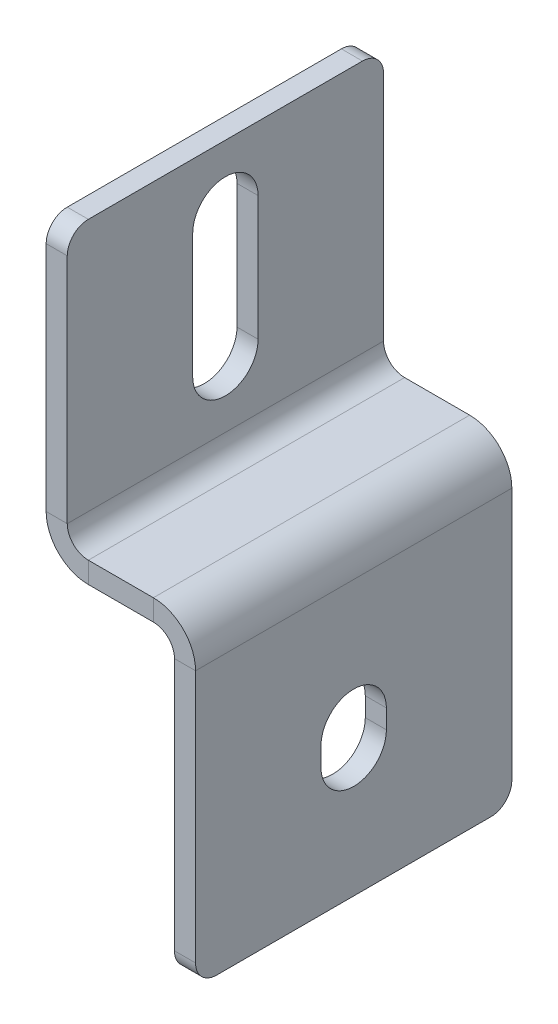
ISO-10303-21;
HEADER;
FILE_DESCRIPTION(('STEP AP214'),'2;1');
FILE_NAME('part.step','',(''),(''),'','','');
FILE_SCHEMA(('AUTOMOTIVE_DESIGN { 1 0 10303 214 1 1 1 1 }'));
ENDSEC;
DATA;
#1=APPLICATION_CONTEXT('core data for automotive mechanical design processes');
#2=APPLICATION_PROTOCOL_DEFINITION('international standard','automotive_design',2000,#1);
#3=PRODUCT_CONTEXT('',#1,'mechanical');
#4=PRODUCT('Part','Part','',(#3));
#5=PRODUCT_RELATED_PRODUCT_CATEGORY('part','',(#4));
#6=PRODUCT_DEFINITION_FORMATION('','',#4);
#7=PRODUCT_DEFINITION_CONTEXT('part definition',#1,'design');
#8=PRODUCT_DEFINITION('design','',#6,#7);
#9=PRODUCT_DEFINITION_SHAPE('','',#8);
#10=(LENGTH_UNIT() NAMED_UNIT(*) SI_UNIT(.MILLI.,.METRE.));
#11=(NAMED_UNIT(*) PLANE_ANGLE_UNIT() SI_UNIT($,.RADIAN.));
#12=(NAMED_UNIT(*) SI_UNIT($,.STERADIAN.) SOLID_ANGLE_UNIT());
#13=UNCERTAINTY_MEASURE_WITH_UNIT(LENGTH_MEASURE(1.E-05),#10,'distance_accuracy_value','');
#14=(GEOMETRIC_REPRESENTATION_CONTEXT(3) GLOBAL_UNCERTAINTY_ASSIGNED_CONTEXT((#13)) GLOBAL_UNIT_ASSIGNED_CONTEXT((#10,
#11,#12)) REPRESENTATION_CONTEXT('',''));
#15=CARTESIAN_POINT('',(0.,0.,0.));
#16=DIRECTION('',(0.,0.,1.));
#17=DIRECTION('',(1.,0.,0.));
#18=AXIS2_PLACEMENT_3D('',#15,#16,#17);
#19=CARTESIAN_POINT('',(0.,-17.9,18.1));
#20=DIRECTION('',(0.,0.,-1.));
#21=DIRECTION('',(0.,-1.,0.));
#22=AXIS2_PLACEMENT_3D('',#19,#20,#21);
#23=PLANE('',#22);
#24=DIRECTION('',(1.,0.,0.));
#25=VECTOR('',#24,1.);
#26=CARTESIAN_POINT('',(0.,-17.9,18.1));
#27=LINE('',#26,#25);
#28=CARTESIAN_POINT('',(-2.,-17.9,18.1));
#29=VERTEX_POINT('',#28);
#30=CARTESIAN_POINT('',(0.,-17.9,18.1));
#31=VERTEX_POINT('',#30);
#32=EDGE_CURVE('E203',#29,#31,#27,.T.);
#33=ORIENTED_EDGE('',*,*,#32,.F.);
#34=DIRECTION('',(0.,-1.,0.));
#35=VECTOR('',#34,1.);
#36=CARTESIAN_POINT('',(-2.,0.,18.1));
#37=LINE('',#36,#35);
#38=CARTESIAN_POINT('',(-2.,-16.1,18.1));
#39=VERTEX_POINT('',#38);
#40=EDGE_CURVE('E323',#39,#29,#37,.T.);
#41=ORIENTED_EDGE('',*,*,#40,.F.);
#42=DIRECTION('',(1.,0.,0.));
#43=VECTOR('',#42,1.);
#44=CARTESIAN_POINT('',(0.,-16.1,18.1));
#45=LINE('',#44,#43);
#46=CARTESIAN_POINT('',(0.,-16.1,18.1));
#47=VERTEX_POINT('',#46);
#48=EDGE_CURVE('E352',#39,#47,#45,.T.);
#49=ORIENTED_EDGE('',*,*,#48,.T.);
#50=DIRECTION('',(0.,-1.,0.));
#51=VECTOR('',#50,1.);
#52=CARTESIAN_POINT('',(0.,-17.9,18.1));
#53=LINE('',#52,#51);
#54=EDGE_CURVE('E204',#47,#31,#53,.T.);
#55=ORIENTED_EDGE('',*,*,#54,.T.);
#56=EDGE_LOOP('',(#33,#41,#49,#55));
#57=FACE_BOUND('',#56,.T.);
#58=ADVANCED_FACE('F14',(#57),#23,.T.);
#59=CARTESIAN_POINT('',(0.,-16.1,15.));
#60=DIRECTION('',(-1.,0.,0.));
#61=DIRECTION('',(0.,-1.,0.));
#62=AXIS2_PLACEMENT_3D('',#59,#60,#61);
#63=CYLINDRICAL_SURFACE('',#62,3.10000000000003);
#64=ORIENTED_EDGE('',*,*,#48,.F.);
#65=CARTESIAN_POINT('',(-1.99999999999999,-16.1,15.));
#66=DIRECTION('',(1.,0.,0.));
#67=DIRECTION('',(0.,1.,0.));
#68=AXIS2_PLACEMENT_3D('',#65,#66,#67);
#69=CIRCLE('',#68,3.10000000000003);
#70=CARTESIAN_POINT('',(-2.,-16.1,11.8999999999999));
#71=VERTEX_POINT('',#70);
#72=EDGE_CURVE('E309',#71,#39,#69,.T.);
#73=ORIENTED_EDGE('',*,*,#72,.F.);
#74=DIRECTION('',(1.,0.,0.));
#75=VECTOR('',#74,1.);
#76=CARTESIAN_POINT('',(0.,-16.1,11.8999999999999));
#77=LINE('',#76,#75);
#78=CARTESIAN_POINT('',(0.,-16.1,11.8999999999999));
#79=VERTEX_POINT('',#78);
#80=EDGE_CURVE('E188',#71,#79,#77,.T.);
#81=ORIENTED_EDGE('',*,*,#80,.T.);
#82=CARTESIAN_POINT('',(0.,-16.1,15.));
#83=DIRECTION('',(1.,0.,0.));
#84=DIRECTION('',(0.,1.,0.));
#85=AXIS2_PLACEMENT_3D('',#82,#83,#84);
#86=CIRCLE('',#85,3.10000000000003);
#87=EDGE_CURVE('E199',#79,#47,#86,.T.);
#88=ORIENTED_EDGE('',*,*,#87,.T.);
#89=EDGE_LOOP('',(#64,#73,#81,#88));
#90=FACE_BOUND('',#89,.T.);
#91=ADVANCED_FACE('F487',(#90),#63,.F.);
#92=CARTESIAN_POINT('',(0.,-17.9,11.9));
#93=DIRECTION('',(0.,0.,1.));
#94=DIRECTION('',(0.,1.,0.));
#95=AXIS2_PLACEMENT_3D('',#92,#93,#94);
#96=PLANE('',#95);
#97=ORIENTED_EDGE('',*,*,#80,.F.);
#98=DIRECTION('',(0.,-1.,0.));
#99=VECTOR('',#98,1.);
#100=CARTESIAN_POINT('',(-2.,0.,11.9));
#101=LINE('',#100,#99);
#102=CARTESIAN_POINT('',(-2.,-17.9,11.9));
#103=VERTEX_POINT('',#102);
#104=EDGE_CURVE('E183',#103,#71,#101,.F.);
#105=ORIENTED_EDGE('',*,*,#104,.F.);
#106=DIRECTION('',(1.,0.,0.));
#107=VECTOR('',#106,1.);
#108=CARTESIAN_POINT('',(0.,-17.9,11.9));
#109=LINE('',#108,#107);
#110=CARTESIAN_POINT('',(0.,-17.9,11.9));
#111=VERTEX_POINT('',#110);
#112=EDGE_CURVE('E177',#103,#111,#109,.T.);
#113=ORIENTED_EDGE('',*,*,#112,.T.);
#114=DIRECTION('',(0.,1.,0.));
#115=VECTOR('',#114,1.);
#116=CARTESIAN_POINT('',(0.,-17.9,11.9));
#117=LINE('',#116,#115);
#118=EDGE_CURVE('E180',#111,#79,#117,.T.);
#119=ORIENTED_EDGE('',*,*,#118,.T.);
#120=EDGE_LOOP('',(#97,#105,#113,#119));
#121=FACE_BOUND('',#120,.T.);
#122=ADVANCED_FACE('F179',(#121),#96,.T.);
#123=CARTESIAN_POINT('',(-12.17,0.,30.));
#124=DIRECTION('',(0.,0.,1.));
#125=DIRECTION('',(-1.,0.,0.));
#126=AXIS2_PLACEMENT_3D('',#123,#124,#125);
#127=PLANE('',#126);
#128=DIRECTION('',(0.,1.,0.));
#129=VECTOR('',#128,1.);
#130=CARTESIAN_POINT('',(-10.17,0.,30.));
#131=LINE('',#130,#129);
#132=CARTESIAN_POINT('',(-10.17,-2.,30.));
#133=VERTEX_POINT('',#132);
#134=CARTESIAN_POINT('',(-10.17,0.,30.));
#135=VERTEX_POINT('',#134);
#136=EDGE_CURVE('E189',#133,#135,#131,.T.);
#137=ORIENTED_EDGE('',*,*,#136,.F.);
#138=DIRECTION('',(1.,0.,0.));
#139=VECTOR('',#138,1.);
#140=CARTESIAN_POINT('',(-12.17,-2.,30.));
#141=LINE('',#140,#139);
#142=CARTESIAN_POINT('',(-4.,-2.,30.));
#143=VERTEX_POINT('',#142);
#144=EDGE_CURVE('E301',#143,#133,#141,.F.);
#145=ORIENTED_EDGE('',*,*,#144,.F.);
#146=DIRECTION('',(0.,1.,0.));
#147=VECTOR('',#146,1.);
#148=CARTESIAN_POINT('',(-4.,0.,30.));
#149=LINE('',#148,#147);
#150=CARTESIAN_POINT('',(-4.,0.,30.));
#151=VERTEX_POINT('',#150);
#152=EDGE_CURVE('E347',#143,#151,#149,.T.);
#153=ORIENTED_EDGE('',*,*,#152,.T.);
#154=DIRECTION('',(-1.,0.,0.));
#155=VECTOR('',#154,1.);
#156=CARTESIAN_POINT('',(-12.17,0.,30.));
#157=LINE('',#156,#155);
#158=EDGE_CURVE('E200',#151,#135,#157,.T.);
#159=ORIENTED_EDGE('',*,*,#158,.T.);
#160=EDGE_LOOP('',(#137,#145,#153,#159));
#161=FACE_BOUND('',#160,.T.);
#162=ADVANCED_FACE('F415',(#161),#127,.T.);
#163=CARTESIAN_POINT('',(-4.,-4.,30.));
#164=DIRECTION('',(0.,0.,-1.));
#165=DIRECTION('',(-1.,0.,0.));
#166=AXIS2_PLACEMENT_3D('',#163,#164,#165);
#167=PLANE('',#166);
#168=ORIENTED_EDGE('',*,*,#152,.F.);
#169=CARTESIAN_POINT('',(-4.,-4.,30.));
#170=DIRECTION('',(0.,0.,-1.));
#171=DIRECTION('',(-1.,0.,0.));
#172=AXIS2_PLACEMENT_3D('',#169,#170,#171);
#173=CIRCLE('',#172,2.);
#174=CARTESIAN_POINT('',(-2.,-4.,30.));
#175=VERTEX_POINT('',#174);
#176=EDGE_CURVE('E302',#143,#175,#173,.T.);
#177=ORIENTED_EDGE('',*,*,#176,.T.);
#178=DIRECTION('',(1.,0.,0.));
#179=VECTOR('',#178,1.);
#180=CARTESIAN_POINT('',(0.,-4.,30.));
#181=LINE('',#180,#179);
#182=CARTESIAN_POINT('',(0.,-4.,30.));
#183=VERTEX_POINT('',#182);
#184=EDGE_CURVE('E344',#175,#183,#181,.T.);
#185=ORIENTED_EDGE('',*,*,#184,.T.);
#186=CARTESIAN_POINT('',(-4.,-4.,30.));
#187=DIRECTION('',(0.,0.,1.));
#188=DIRECTION('',(1.,0.,0.));
#189=AXIS2_PLACEMENT_3D('',#186,#187,#188);
#190=CIRCLE('',#189,4.);
#191=EDGE_CURVE('E246',#151,#183,#190,.F.);
#192=ORIENTED_EDGE('',*,*,#191,.F.);
#193=EDGE_LOOP('',(#168,#177,#185,#192));
#194=FACE_BOUND('',#193,.T.);
#195=ADVANCED_FACE('F448',(#194),#167,.F.);
#196=CARTESIAN_POINT('',(0.,0.,30.));
#197=DIRECTION('',(0.,0.,1.));
#198=DIRECTION('',(0.,1.,0.));
#199=AXIS2_PLACEMENT_3D('',#196,#197,#198);
#200=PLANE('',#199);
#201=DIRECTION('',(0.,-1.,0.));
#202=VECTOR('',#201,1.);
#203=CARTESIAN_POINT('',(-2.,0.,30.));
#204=LINE('',#203,#202);
#205=CARTESIAN_POINT('',(-2.,-28.,30.));
#206=VERTEX_POINT('',#205);
#207=EDGE_CURVE('E308',#206,#175,#204,.F.);
#208=ORIENTED_EDGE('',*,*,#207,.F.);
#209=DIRECTION('',(-1.,0.,0.));
#210=VECTOR('',#209,1.);
#211=CARTESIAN_POINT('',(0.,-28.,30.));
#212=LINE('',#211,#210);
#213=CARTESIAN_POINT('',(0.,-28.,30.));
#214=VERTEX_POINT('',#213);
#215=EDGE_CURVE('E370',#206,#214,#212,.F.);
#216=ORIENTED_EDGE('',*,*,#215,.T.);
#217=DIRECTION('',(0.,1.,0.));
#218=VECTOR('',#217,1.);
#219=CARTESIAN_POINT('',(0.,0.,30.));
#220=LINE('',#219,#218);
#221=EDGE_CURVE('E212',#214,#183,#220,.T.);
#222=ORIENTED_EDGE('',*,*,#221,.T.);
#223=ORIENTED_EDGE('',*,*,#184,.F.);
#224=EDGE_LOOP('',(#208,#216,#222,#223));
#225=FACE_BOUND('',#224,.T.);
#226=ADVANCED_FACE('F476',(#225),#200,.T.);
#227=CARTESIAN_POINT('',(0.,-30.,30.));
#228=DIRECTION('',(0.,1.,0.));
#229=DIRECTION('',(0.,0.,-1.));
#230=AXIS2_PLACEMENT_3D('',#227,#228,#229);
#231=PLANE('',#230);
#232=DIRECTION('',(0.,0.,1.));
#233=VECTOR('',#232,1.);
#234=CARTESIAN_POINT('',(-2.,-30.,30.));
#235=LINE('',#234,#233);
#236=CARTESIAN_POINT('',(-2.,-30.,28.));
#237=VERTEX_POINT('',#236);
#238=CARTESIAN_POINT('',(-2.,-30.,2.));
#239=VERTEX_POINT('',#238);
#240=EDGE_CURVE('E279',#237,#239,#235,.F.);
#241=ORIENTED_EDGE('',*,*,#240,.T.);
#242=DIRECTION('',(-1.,0.,0.));
#243=VECTOR('',#242,1.);
#244=CARTESIAN_POINT('',(0.,-30.,2.));
#245=LINE('',#244,#243);
#246=CARTESIAN_POINT('',(0.,-30.,2.));
#247=VERTEX_POINT('',#246);
#248=EDGE_CURVE('E357',#239,#247,#245,.F.);
#249=ORIENTED_EDGE('',*,*,#248,.T.);
#250=DIRECTION('',(0.,0.,-1.));
#251=VECTOR('',#250,1.);
#252=CARTESIAN_POINT('',(0.,-30.,30.));
#253=LINE('',#252,#251);
#254=CARTESIAN_POINT('',(0.,-30.,28.));
#255=VERTEX_POINT('',#254);
#256=EDGE_CURVE('E214',#255,#247,#253,.T.);
#257=ORIENTED_EDGE('',*,*,#256,.F.);
#258=DIRECTION('',(1.,0.,0.));
#259=VECTOR('',#258,1.);
#260=CARTESIAN_POINT('',(0.,-30.,28.));
#261=LINE('',#260,#259);
#262=EDGE_CURVE('E354',#255,#237,#261,.F.);
#263=ORIENTED_EDGE('',*,*,#262,.T.);
#264=EDGE_LOOP('',(#241,#249,#257,#263));
#265=FACE_BOUND('',#264,.T.);
#266=ADVANCED_FACE('F468',(#265),#231,.F.);
#267=CARTESIAN_POINT('',(0.,0.,0.));
#268=DIRECTION('',(0.,0.,1.));
#269=DIRECTION('',(0.,1.,0.));
#270=AXIS2_PLACEMENT_3D('',#267,#268,#269);
#271=PLANE('',#270);
#272=DIRECTION('',(0.,1.,0.));
#273=VECTOR('',#272,1.);
#274=CARTESIAN_POINT('',(0.,0.,0.));
#275=LINE('',#274,#273);
#276=CARTESIAN_POINT('',(0.,-28.,0.));
#277=VERTEX_POINT('',#276);
#278=CARTESIAN_POINT('',(0.,-4.,0.));
#279=VERTEX_POINT('',#278);
#280=EDGE_CURVE('E210',#277,#279,#275,.T.);
#281=ORIENTED_EDGE('',*,*,#280,.F.);
#282=DIRECTION('',(-1.,0.,0.));
#283=VECTOR('',#282,1.);
#284=CARTESIAN_POINT('',(0.,-28.,0.));
#285=LINE('',#284,#283);
#286=CARTESIAN_POINT('',(-2.,-28.,0.));
#287=VERTEX_POINT('',#286);
#288=EDGE_CURVE('E364',#277,#287,#285,.T.);
#289=ORIENTED_EDGE('',*,*,#288,.T.);
#290=DIRECTION('',(0.,-1.,0.));
#291=VECTOR('',#290,1.);
#292=CARTESIAN_POINT('',(-2.,0.,0.));
#293=LINE('',#292,#291);
#294=CARTESIAN_POINT('',(-2.,-4.,0.));
#295=VERTEX_POINT('',#294);
#296=EDGE_CURVE('E306',#287,#295,#293,.F.);
#297=ORIENTED_EDGE('',*,*,#296,.T.);
#298=DIRECTION('',(1.,0.,0.));
#299=VECTOR('',#298,1.);
#300=CARTESIAN_POINT('',(0.,-4.,0.));
#301=LINE('',#300,#299);
#302=EDGE_CURVE('E341',#295,#279,#301,.T.);
#303=ORIENTED_EDGE('',*,*,#302,.T.);
#304=EDGE_LOOP('',(#281,#289,#297,#303));
#305=FACE_BOUND('',#304,.T.);
#306=ADVANCED_FACE('F457',(#305),#271,.F.);
#307=CARTESIAN_POINT('',(-4.,-4.,0.));
#308=DIRECTION('',(0.,0.,1.));
#309=DIRECTION('',(1.,0.,0.));
#310=AXIS2_PLACEMENT_3D('',#307,#308,#309);
#311=PLANE('',#310);
#312=ORIENTED_EDGE('',*,*,#302,.F.);
#313=CARTESIAN_POINT('',(-4.,-4.,0.));
#314=DIRECTION('',(0.,0.,-1.));
#315=DIRECTION('',(-1.,0.,0.));
#316=AXIS2_PLACEMENT_3D('',#313,#314,#315);
#317=CIRCLE('',#316,2.);
#318=CARTESIAN_POINT('',(-4.,-2.,0.));
#319=VERTEX_POINT('',#318);
#320=EDGE_CURVE('E303',#295,#319,#317,.F.);
#321=ORIENTED_EDGE('',*,*,#320,.T.);
#322=DIRECTION('',(0.,1.,0.));
#323=VECTOR('',#322,1.);
#324=CARTESIAN_POINT('',(-4.,0.,0.));
#325=LINE('',#324,#323);
#326=CARTESIAN_POINT('',(-4.,0.,0.));
#327=VERTEX_POINT('',#326);
#328=EDGE_CURVE('E339',#319,#327,#325,.T.);
#329=ORIENTED_EDGE('',*,*,#328,.T.);
#330=CARTESIAN_POINT('',(-4.,-4.,0.));
#331=DIRECTION('',(0.,0.,-1.));
#332=DIRECTION('',(-1.,0.,0.));
#333=AXIS2_PLACEMENT_3D('',#330,#331,#332);
#334=CIRCLE('',#333,4.);
#335=EDGE_CURVE('E243',#279,#327,#334,.F.);
#336=ORIENTED_EDGE('',*,*,#335,.F.);
#337=EDGE_LOOP('',(#312,#321,#329,#336));
#338=FACE_BOUND('',#337,.T.);
#339=ADVANCED_FACE('F442',(#338),#311,.F.);
#340=CARTESIAN_POINT('',(-12.17,0.,0.));
#341=DIRECTION('',(0.,0.,1.));
#342=DIRECTION('',(-1.,0.,0.));
#343=AXIS2_PLACEMENT_3D('',#340,#341,#342);
#344=PLANE('',#343);
#345=ORIENTED_EDGE('',*,*,#328,.F.);
#346=DIRECTION('',(1.,0.,0.));
#347=VECTOR('',#346,1.);
#348=CARTESIAN_POINT('',(-12.17,-2.,0.));
#349=LINE('',#348,#347);
#350=CARTESIAN_POINT('',(-10.17,-2.,0.));
#351=VERTEX_POINT('',#350);
#352=EDGE_CURVE('E298',#319,#351,#349,.F.);
#353=ORIENTED_EDGE('',*,*,#352,.T.);
#354=DIRECTION('',(0.,1.,0.));
#355=VECTOR('',#354,1.);
#356=CARTESIAN_POINT('',(-10.17,0.,0.));
#357=LINE('',#356,#355);
#358=CARTESIAN_POINT('',(-10.17,0.,0.));
#359=VERTEX_POINT('',#358);
#360=EDGE_CURVE('E337',#351,#359,#357,.T.);
#361=ORIENTED_EDGE('',*,*,#360,.T.);
#362=DIRECTION('',(-1.,0.,0.));
#363=VECTOR('',#362,1.);
#364=CARTESIAN_POINT('',(-12.17,0.,0.));
#365=LINE('',#364,#363);
#366=EDGE_CURVE('E250',#327,#359,#365,.T.);
#367=ORIENTED_EDGE('',*,*,#366,.F.);
#368=EDGE_LOOP('',(#345,#353,#361,#367));
#369=FACE_BOUND('',#368,.T.);
#370=ADVANCED_FACE('F434',(#369),#344,.F.);
#371=CARTESIAN_POINT('',(-10.17,2.,0.));
#372=DIRECTION('',(0.,0.,-1.));
#373=DIRECTION('',(-1.,0.,0.));
#374=AXIS2_PLACEMENT_3D('',#371,#372,#373);
#375=PLANE('',#374);
#376=ORIENTED_EDGE('',*,*,#360,.F.);
#377=CARTESIAN_POINT('',(-10.17,2.,0.));
#378=DIRECTION('',(0.,0.,1.));
#379=DIRECTION('',(1.,0.,0.));
#380=AXIS2_PLACEMENT_3D('',#377,#378,#379);
#381=CIRCLE('',#380,4.);
#382=CARTESIAN_POINT('',(-14.17,2.,0.));
#383=VERTEX_POINT('',#382);
#384=EDGE_CURVE('E294',#351,#383,#381,.F.);
#385=ORIENTED_EDGE('',*,*,#384,.T.);
#386=DIRECTION('',(1.,0.,0.));
#387=VECTOR('',#386,1.);
#388=CARTESIAN_POINT('',(-12.17,2.,0.));
#389=LINE('',#388,#387);
#390=CARTESIAN_POINT('',(-12.17,2.,0.));
#391=VERTEX_POINT('',#390);
#392=EDGE_CURVE('E335',#383,#391,#389,.T.);
#393=ORIENTED_EDGE('',*,*,#392,.T.);
#394=CARTESIAN_POINT('',(-10.17,2.,0.));
#395=DIRECTION('',(0.,0.,1.));
#396=DIRECTION('',(1.,0.,0.));
#397=AXIS2_PLACEMENT_3D('',#394,#395,#396);
#398=CIRCLE('',#397,2.);
#399=EDGE_CURVE('E257',#359,#391,#398,.F.);
#400=ORIENTED_EDGE('',*,*,#399,.F.);
#401=EDGE_LOOP('',(#376,#385,#393,#400));
#402=FACE_BOUND('',#401,.T.);
#403=ADVANCED_FACE('F427',(#402),#375,.T.);
#404=CARTESIAN_POINT('',(-12.17,26.,0.));
#405=DIRECTION('',(0.,0.,1.));
#406=DIRECTION('',(0.,1.,0.));
#407=AXIS2_PLACEMENT_3D('',#404,#405,#406);
#408=PLANE('',#407);
#409=DIRECTION('',(0.,-1.,0.));
#410=VECTOR('',#409,1.);
#411=CARTESIAN_POINT('',(-14.17,26.,0.));
#412=LINE('',#411,#410);
#413=CARTESIAN_POINT('',(-14.17,24.,0.));
#414=VERTEX_POINT('',#413);
#415=EDGE_CURVE('E283',#383,#414,#412,.F.);
#416=ORIENTED_EDGE('',*,*,#415,.T.);
#417=DIRECTION('',(1.,0.,0.));
#418=VECTOR('',#417,1.);
#419=CARTESIAN_POINT('',(-12.17,24.,0.));
#420=LINE('',#419,#418);
#421=CARTESIAN_POINT('',(-12.17,24.,0.));
#422=VERTEX_POINT('',#421);
#423=EDGE_CURVE('E373',#414,#422,#420,.T.);
#424=ORIENTED_EDGE('',*,*,#423,.T.);
#425=DIRECTION('',(0.,1.,0.));
#426=VECTOR('',#425,1.);
#427=CARTESIAN_POINT('',(-12.17,26.,0.));
#428=LINE('',#427,#426);
#429=EDGE_CURVE('E229',#391,#422,#428,.T.);
#430=ORIENTED_EDGE('',*,*,#429,.F.);
#431=ORIENTED_EDGE('',*,*,#392,.F.);
#432=EDGE_LOOP('',(#416,#424,#430,#431));
#433=FACE_BOUND('',#432,.T.);
#434=ADVANCED_FACE('F393',(#433),#408,.F.);
#435=CARTESIAN_POINT('',(-12.17,26.,30.));
#436=DIRECTION('',(0.,1.,0.));
#437=DIRECTION('',(0.,0.,-1.));
#438=AXIS2_PLACEMENT_3D('',#435,#436,#437);
#439=PLANE('',#438);
#440=DIRECTION('',(0.,0.,-1.));
#441=VECTOR('',#440,1.);
#442=CARTESIAN_POINT('',(-12.17,26.,30.));
#443=LINE('',#442,#441);
#444=CARTESIAN_POINT('',(-12.17,26.,28.));
#445=VERTEX_POINT('',#444);
#446=CARTESIAN_POINT('',(-12.17,26.,2.));
#447=VERTEX_POINT('',#446);
#448=EDGE_CURVE('E232',#445,#447,#443,.T.);
#449=ORIENTED_EDGE('',*,*,#448,.T.);
#450=DIRECTION('',(-1.,0.,0.));
#451=VECTOR('',#450,1.);
#452=CARTESIAN_POINT('',(-12.17,26.,2.));
#453=LINE('',#452,#451);
#454=CARTESIAN_POINT('',(-14.17,26.,2.));
#455=VERTEX_POINT('',#454);
#456=EDGE_CURVE('E35',#447,#455,#453,.T.);
#457=ORIENTED_EDGE('',*,*,#456,.T.);
#458=DIRECTION('',(0.,0.,1.));
#459=VECTOR('',#458,1.);
#460=CARTESIAN_POINT('',(-14.17,26.,30.));
#461=LINE('',#460,#459);
#462=CARTESIAN_POINT('',(-14.17,26.,28.));
#463=VERTEX_POINT('',#462);
#464=EDGE_CURVE('E290',#463,#455,#461,.F.);
#465=ORIENTED_EDGE('',*,*,#464,.F.);
#466=DIRECTION('',(1.,0.,0.));
#467=VECTOR('',#466,1.);
#468=CARTESIAN_POINT('',(-12.17,26.,28.));
#469=LINE('',#468,#467);
#470=EDGE_CURVE('E380',#463,#445,#469,.T.);
#471=ORIENTED_EDGE('',*,*,#470,.T.);
#472=EDGE_LOOP('',(#449,#457,#465,#471));
#473=FACE_BOUND('',#472,.T.);
#474=ADVANCED_FACE('F399',(#473),#439,.T.);
#475=CARTESIAN_POINT('',(-12.17,26.,30.));
#476=DIRECTION('',(0.,0.,1.));
#477=DIRECTION('',(0.,1.,0.));
#478=AXIS2_PLACEMENT_3D('',#475,#476,#477);
#479=PLANE('',#478);
#480=DIRECTION('',(0.,1.,0.));
#481=VECTOR('',#480,1.);
#482=CARTESIAN_POINT('',(-12.17,26.,30.));
#483=LINE('',#482,#481);
#484=CARTESIAN_POINT('',(-12.17,2.,30.));
#485=VERTEX_POINT('',#484);
#486=CARTESIAN_POINT('',(-12.17,24.,30.));
#487=VERTEX_POINT('',#486);
#488=EDGE_CURVE('E234',#485,#487,#483,.T.);
#489=ORIENTED_EDGE('',*,*,#488,.T.);
#490=DIRECTION('',(1.,0.,0.));
#491=VECTOR('',#490,1.);
#492=CARTESIAN_POINT('',(-12.17,24.,30.));
#493=LINE('',#492,#491);
#494=CARTESIAN_POINT('',(-14.17,24.,30.));
#495=VERTEX_POINT('',#494);
#496=EDGE_CURVE('E9',#487,#495,#493,.F.);
#497=ORIENTED_EDGE('',*,*,#496,.T.);
#498=DIRECTION('',(0.,-1.,0.));
#499=VECTOR('',#498,1.);
#500=CARTESIAN_POINT('',(-14.17,26.,30.));
#501=LINE('',#500,#499);
#502=CARTESIAN_POINT('',(-14.17,2.,30.));
#503=VERTEX_POINT('',#502);
#504=EDGE_CURVE('E272',#503,#495,#501,.F.);
#505=ORIENTED_EDGE('',*,*,#504,.F.);
#506=DIRECTION('',(1.,0.,0.));
#507=VECTOR('',#506,1.);
#508=CARTESIAN_POINT('',(-12.17,2.,30.));
#509=LINE('',#508,#507);
#510=EDGE_CURVE('E333',#503,#485,#509,.T.);
#511=ORIENTED_EDGE('',*,*,#510,.T.);
#512=EDGE_LOOP('',(#489,#497,#505,#511));
#513=FACE_BOUND('',#512,.T.);
#514=ADVANCED_FACE('F405',(#513),#479,.T.);
#515=CARTESIAN_POINT('',(-12.17,26.,11.9));
#516=DIRECTION('',(0.,0.,-1.));
#517=DIRECTION('',(0.,-1.,0.));
#518=AXIS2_PLACEMENT_3D('',#515,#516,#517);
#519=PLANE('',#518);
#520=DIRECTION('',(1.,0.,0.));
#521=VECTOR('',#520,1.);
#522=CARTESIAN_POINT('',(-12.17,19.9,11.9));
#523=LINE('',#522,#521);
#524=CARTESIAN_POINT('',(-14.17,19.9,11.9));
#525=VERTEX_POINT('',#524);
#526=CARTESIAN_POINT('',(-12.17,19.9,11.9));
#527=VERTEX_POINT('',#526);
#528=EDGE_CURVE('E331',#525,#527,#523,.T.);
#529=ORIENTED_EDGE('',*,*,#528,.F.);
#530=DIRECTION('',(0.,-1.,0.));
#531=VECTOR('',#530,1.);
#532=CARTESIAN_POINT('',(-14.17,26.,11.9));
#533=LINE('',#532,#531);
#534=CARTESIAN_POINT('',(-14.17,8.10000000000001,11.9));
#535=VERTEX_POINT('',#534);
#536=EDGE_CURVE('E284',#525,#535,#533,.T.);
#537=ORIENTED_EDGE('',*,*,#536,.T.);
#538=DIRECTION('',(1.,0.,0.));
#539=VECTOR('',#538,1.);
#540=CARTESIAN_POINT('',(-12.17,8.10000000000001,11.9));
#541=LINE('',#540,#539);
#542=CARTESIAN_POINT('',(-12.17,8.10000000000001,11.9));
#543=VERTEX_POINT('',#542);
#544=EDGE_CURVE('E329',#535,#543,#541,.T.);
#545=ORIENTED_EDGE('',*,*,#544,.T.);
#546=DIRECTION('',(0.,-1.,0.));
#547=VECTOR('',#546,1.);
#548=CARTESIAN_POINT('',(-12.17,26.,11.9));
#549=LINE('',#548,#547);
#550=EDGE_CURVE('E223',#527,#543,#549,.T.);
#551=ORIENTED_EDGE('',*,*,#550,.F.);
#552=EDGE_LOOP('',(#529,#537,#545,#551));
#553=FACE_BOUND('',#552,.T.);
#554=ADVANCED_FACE('F658',(#553),#519,.F.);
#555=CARTESIAN_POINT('',(-12.17,8.10000000000001,15.));
#556=DIRECTION('',(-1.,0.,0.));
#557=DIRECTION('',(0.,-1.,0.));
#558=AXIS2_PLACEMENT_3D('',#555,#556,#557);
#559=CYLINDRICAL_SURFACE('',#558,3.1);
#560=ORIENTED_EDGE('',*,*,#544,.F.);
#561=CARTESIAN_POINT('',(-14.17,8.10000000000001,15.));
#562=DIRECTION('',(-1.,0.,0.));
#563=DIRECTION('',(0.,-1.,0.));
#564=AXIS2_PLACEMENT_3D('',#561,#562,#563);
#565=CIRCLE('',#564,3.1);
#566=CARTESIAN_POINT('',(-14.17,8.10000000000001,18.1));
#567=VERTEX_POINT('',#566);
#568=EDGE_CURVE('E280',#535,#567,#565,.T.);
#569=ORIENTED_EDGE('',*,*,#568,.T.);
#570=DIRECTION('',(1.,0.,0.));
#571=VECTOR('',#570,1.);
#572=CARTESIAN_POINT('',(-12.17,8.10000000000001,18.1));
#573=LINE('',#572,#571);
#574=CARTESIAN_POINT('',(-12.17,8.10000000000001,18.1));
#575=VERTEX_POINT('',#574);
#576=EDGE_CURVE('E327',#567,#575,#573,.T.);
#577=ORIENTED_EDGE('',*,*,#576,.T.);
#578=CARTESIAN_POINT('',(-12.17,8.10000000000001,15.));
#579=DIRECTION('',(-1.,0.,0.));
#580=DIRECTION('',(0.,-1.,0.));
#581=AXIS2_PLACEMENT_3D('',#578,#579,#580);
#582=CIRCLE('',#581,3.1);
#583=EDGE_CURVE('E226',#543,#575,#582,.T.);
#584=ORIENTED_EDGE('',*,*,#583,.F.);
#585=EDGE_LOOP('',(#560,#569,#577,#584));
#586=FACE_BOUND('',#585,.T.);
#587=ADVANCED_FACE('F648',(#586),#559,.F.);
#588=CARTESIAN_POINT('',(-12.17,26.,18.1));
#589=DIRECTION('',(0.,0.,1.));
#590=DIRECTION('',(0.,1.,0.));
#591=AXIS2_PLACEMENT_3D('',#588,#589,#590);
#592=PLANE('',#591);
#593=ORIENTED_EDGE('',*,*,#576,.F.);
#594=DIRECTION('',(0.,-1.,0.));
#595=VECTOR('',#594,1.);
#596=CARTESIAN_POINT('',(-14.17,26.,18.1));
#597=LINE('',#596,#595);
#598=CARTESIAN_POINT('',(-14.17,19.9,18.1));
#599=VERTEX_POINT('',#598);
#600=EDGE_CURVE('E275',#567,#599,#597,.F.);
#601=ORIENTED_EDGE('',*,*,#600,.T.);
#602=DIRECTION('',(1.,0.,0.));
#603=VECTOR('',#602,1.);
#604=CARTESIAN_POINT('',(-12.17,19.9,18.1));
#605=LINE('',#604,#603);
#606=CARTESIAN_POINT('',(-12.17,19.9,18.1));
#607=VERTEX_POINT('',#606);
#608=EDGE_CURVE('E256',#599,#607,#605,.T.);
#609=ORIENTED_EDGE('',*,*,#608,.T.);
#610=DIRECTION('',(0.,1.,0.));
#611=VECTOR('',#610,1.);
#612=CARTESIAN_POINT('',(-12.17,26.,18.1));
#613=LINE('',#612,#611);
#614=EDGE_CURVE('E217',#575,#607,#613,.T.);
#615=ORIENTED_EDGE('',*,*,#614,.F.);
#616=EDGE_LOOP('',(#593,#601,#609,#615));
#617=FACE_BOUND('',#616,.T.);
#618=ADVANCED_FACE('F500',(#617),#592,.F.);
#619=CARTESIAN_POINT('',(0.,-17.9,15.));
#620=DIRECTION('',(-1.,0.,0.));
#621=DIRECTION('',(0.,-1.,0.));
#622=AXIS2_PLACEMENT_3D('',#619,#620,#621);
#623=CYLINDRICAL_SURFACE('',#622,3.10000000000003);
#624=CARTESIAN_POINT('',(-1.99999999999998,-17.9,15.));
#625=DIRECTION('',(1.,0.,0.));
#626=DIRECTION('',(0.,1.,0.));
#627=AXIS2_PLACEMENT_3D('',#624,#625,#626);
#628=CIRCLE('',#627,3.10000000000003);
#629=EDGE_CURVE('E320',#29,#103,#628,.T.);
#630=ORIENTED_EDGE('',*,*,#629,.F.);
#631=ORIENTED_EDGE('',*,*,#32,.T.);
#632=CARTESIAN_POINT('',(0.,-17.9,15.));
#633=DIRECTION('',(1.,0.,0.));
#634=DIRECTION('',(0.,1.,0.));
#635=AXIS2_PLACEMENT_3D('',#632,#633,#634);
#636=CIRCLE('',#635,3.10000000000003);
#637=EDGE_CURVE('E196',#31,#111,#636,.T.);
#638=ORIENTED_EDGE('',*,*,#637,.T.);
#639=ORIENTED_EDGE('',*,*,#112,.F.);
#640=EDGE_LOOP('',(#630,#631,#638,#639));
#641=FACE_BOUND('',#640,.T.);
#642=ADVANCED_FACE('F202',(#641),#623,.F.);
#643=CARTESIAN_POINT('',(-12.17,19.9,15.));
#644=DIRECTION('',(-1.,0.,0.));
#645=DIRECTION('',(0.,-1.,0.));
#646=AXIS2_PLACEMENT_3D('',#643,#644,#645);
#647=CYLINDRICAL_SURFACE('',#646,3.1);
#648=CARTESIAN_POINT('',(-14.17,19.9,15.));
#649=DIRECTION('',(-1.,0.,0.));
#650=DIRECTION('',(0.,-1.,0.));
#651=AXIS2_PLACEMENT_3D('',#648,#649,#650);
#652=CIRCLE('',#651,3.1);
#653=EDGE_CURVE('E278',#599,#525,#652,.T.);
#654=ORIENTED_EDGE('',*,*,#653,.T.);
#655=ORIENTED_EDGE('',*,*,#528,.T.);
#656=CARTESIAN_POINT('',(-12.17,19.9,15.));
#657=DIRECTION('',(-1.,0.,0.));
#658=DIRECTION('',(0.,-1.,0.));
#659=AXIS2_PLACEMENT_3D('',#656,#657,#658);
#660=CIRCLE('',#659,3.1);
#661=EDGE_CURVE('E220',#607,#527,#660,.T.);
#662=ORIENTED_EDGE('',*,*,#661,.F.);
#663=ORIENTED_EDGE('',*,*,#608,.F.);
#664=EDGE_LOOP('',(#654,#655,#662,#663));
#665=FACE_BOUND('',#664,.T.);
#666=ADVANCED_FACE('F499',(#665),#647,.F.);
#667=CARTESIAN_POINT('',(-10.17,2.,30.));
#668=DIRECTION('',(0.,0.,1.));
#669=DIRECTION('',(1.,0.,0.));
#670=AXIS2_PLACEMENT_3D('',#667,#668,#669);
#671=PLANE('',#670);
#672=CARTESIAN_POINT('',(-10.17,2.,30.));
#673=DIRECTION('',(0.,0.,1.));
#674=DIRECTION('',(1.,0.,0.));
#675=AXIS2_PLACEMENT_3D('',#672,#673,#674);
#676=CIRCLE('',#675,4.);
#677=EDGE_CURVE('E297',#503,#133,#676,.T.);
#678=ORIENTED_EDGE('',*,*,#677,.T.);
#679=ORIENTED_EDGE('',*,*,#136,.T.);
#680=CARTESIAN_POINT('',(-10.17,2.,30.));
#681=DIRECTION('',(0.,0.,-1.));
#682=DIRECTION('',(-1.,0.,0.));
#683=AXIS2_PLACEMENT_3D('',#680,#681,#682);
#684=CIRCLE('',#683,2.);
#685=EDGE_CURVE('E247',#485,#135,#684,.F.);
#686=ORIENTED_EDGE('',*,*,#685,.F.);
#687=ORIENTED_EDGE('',*,*,#510,.F.);
#688=EDGE_LOOP('',(#678,#679,#686,#687));
#689=FACE_BOUND('',#688,.T.);
#690=ADVANCED_FACE('F408',(#689),#671,.T.);
#691=CARTESIAN_POINT('',(-12.17,26.,30.));
#692=DIRECTION('',(-1.,0.,0.));
#693=DIRECTION('',(0.,-1.,0.));
#694=AXIS2_PLACEMENT_3D('',#691,#692,#693);
#695=PLANE('',#694);
#696=ORIENTED_EDGE('',*,*,#614,.T.);
#697=ORIENTED_EDGE('',*,*,#661,.T.);
#698=ORIENTED_EDGE('',*,*,#550,.T.);
#699=ORIENTED_EDGE('',*,*,#583,.T.);
#700=EDGE_LOOP('',(#696,#697,#698,#699));
#701=FACE_BOUND('',#700,.T.);
#702=ORIENTED_EDGE('',*,*,#429,.T.);
#703=CARTESIAN_POINT('',(-12.17,24.,2.));
#704=DIRECTION('',(-1.,0.,0.));
#705=DIRECTION('',(0.,-1.,0.));
#706=AXIS2_PLACEMENT_3D('',#703,#704,#705);
#707=CIRCLE('',#706,2.);
#708=EDGE_CURVE('E378',#422,#447,#707,.F.);
#709=ORIENTED_EDGE('',*,*,#708,.T.);
#710=ORIENTED_EDGE('',*,*,#448,.F.);
#711=CARTESIAN_POINT('',(-12.17,24.,28.));
#712=DIRECTION('',(-1.,0.,0.));
#713=DIRECTION('',(0.,-1.,0.));
#714=AXIS2_PLACEMENT_3D('',#711,#712,#713);
#715=CIRCLE('',#714,2.);
#716=EDGE_CURVE('E376',#445,#487,#715,.F.);
#717=ORIENTED_EDGE('',*,*,#716,.T.);
#718=ORIENTED_EDGE('',*,*,#488,.F.);
#719=DIRECTION('',(0.,0.,-1.));
#720=VECTOR('',#719,1.);
#721=CARTESIAN_POINT('',(-12.17,2.,0.));
#722=LINE('',#721,#720);
#723=EDGE_CURVE('E242',#485,#391,#722,.T.);
#724=ORIENTED_EDGE('',*,*,#723,.T.);
#725=EDGE_LOOP('',(#702,#709,#710,#717,#718,#724));
#726=FACE_BOUND('',#725,.T.);
#727=ADVANCED_FACE('F398',(#701,#726),#695,.F.);
#728=CARTESIAN_POINT('',(0.,0.,30.));
#729=DIRECTION('',(-1.,0.,0.));
#730=DIRECTION('',(0.,-1.,0.));
#731=AXIS2_PLACEMENT_3D('',#728,#729,#730);
#732=PLANE('',#731);
#733=ORIENTED_EDGE('',*,*,#118,.F.);
#734=ORIENTED_EDGE('',*,*,#637,.F.);
#735=ORIENTED_EDGE('',*,*,#54,.F.);
#736=ORIENTED_EDGE('',*,*,#87,.F.);
#737=EDGE_LOOP('',(#733,#734,#735,#736));
#738=FACE_BOUND('',#737,.T.);
#739=ORIENTED_EDGE('',*,*,#256,.T.);
#740=CARTESIAN_POINT('',(0.,-28.,2.));
#741=DIRECTION('',(-1.,0.,0.));
#742=DIRECTION('',(0.,-1.,0.));
#743=AXIS2_PLACEMENT_3D('',#740,#741,#742);
#744=CIRCLE('',#743,2.);
#745=EDGE_CURVE('E362',#247,#277,#744,.F.);
#746=ORIENTED_EDGE('',*,*,#745,.T.);
#747=ORIENTED_EDGE('',*,*,#280,.T.);
#748=DIRECTION('',(0.,0.,-1.));
#749=VECTOR('',#748,1.);
#750=CARTESIAN_POINT('',(0.,-4.,30.));
#751=LINE('',#750,#749);
#752=EDGE_CURVE('E239',#279,#183,#751,.F.);
#753=ORIENTED_EDGE('',*,*,#752,.T.);
#754=ORIENTED_EDGE('',*,*,#221,.F.);
#755=CARTESIAN_POINT('',(0.,-28.,28.));
#756=DIRECTION('',(-1.,0.,0.));
#757=DIRECTION('',(0.,-1.,0.));
#758=AXIS2_PLACEMENT_3D('',#755,#756,#757);
#759=CIRCLE('',#758,2.);
#760=EDGE_CURVE('E360',#214,#255,#759,.F.);
#761=ORIENTED_EDGE('',*,*,#760,.T.);
#762=EDGE_LOOP('',(#739,#746,#747,#753,#754,#761));
#763=FACE_BOUND('',#762,.T.);
#764=ADVANCED_FACE('F193',(#738,#763),#732,.F.);
#765=CARTESIAN_POINT('',(-12.17,0.,30.));
#766=DIRECTION('',(0.,-1.,0.));
#767=DIRECTION('',(0.,0.,-1.));
#768=AXIS2_PLACEMENT_3D('',#765,#766,#767);
#769=PLANE('',#768);
#770=ORIENTED_EDGE('',*,*,#366,.T.);
#771=DIRECTION('',(0.,0.,-1.));
#772=VECTOR('',#771,1.);
#773=CARTESIAN_POINT('',(-10.17,0.,30.));
#774=LINE('',#773,#772);
#775=EDGE_CURVE('E253',#359,#135,#774,.F.);
#776=ORIENTED_EDGE('',*,*,#775,.T.);
#777=ORIENTED_EDGE('',*,*,#158,.F.);
#778=DIRECTION('',(0.,0.,-1.));
#779=VECTOR('',#778,1.);
#780=CARTESIAN_POINT('',(-4.,0.,30.));
#781=LINE('',#780,#779);
#782=EDGE_CURVE('E236',#151,#327,#781,.T.);
#783=ORIENTED_EDGE('',*,*,#782,.T.);
#784=EDGE_LOOP('',(#770,#776,#777,#783));
#785=FACE_BOUND('',#784,.T.);
#786=ADVANCED_FACE('F420',(#785),#769,.F.);
#787=CARTESIAN_POINT('',(-4.,-4.,30.));
#788=DIRECTION('',(0.,0.,-1.));
#789=DIRECTION('',(-1.,0.,0.));
#790=AXIS2_PLACEMENT_3D('',#787,#788,#789);
#791=CYLINDRICAL_SURFACE('',#790,4.);
#792=ORIENTED_EDGE('',*,*,#191,.T.);
#793=ORIENTED_EDGE('',*,*,#752,.F.);
#794=ORIENTED_EDGE('',*,*,#335,.T.);
#795=ORIENTED_EDGE('',*,*,#782,.F.);
#796=EDGE_LOOP('',(#792,#793,#794,#795));
#797=FACE_BOUND('',#796,.T.);
#798=ADVANCED_FACE('F452',(#797),#791,.T.);
#799=CARTESIAN_POINT('',(-10.17,2.,30.));
#800=DIRECTION('',(0.,0.,1.));
#801=DIRECTION('',(1.,0.,0.));
#802=AXIS2_PLACEMENT_3D('',#799,#800,#801);
#803=CYLINDRICAL_SURFACE('',#802,2.);
#804=ORIENTED_EDGE('',*,*,#685,.T.);
#805=ORIENTED_EDGE('',*,*,#775,.F.);
#806=ORIENTED_EDGE('',*,*,#399,.T.);
#807=ORIENTED_EDGE('',*,*,#723,.F.);
#808=EDGE_LOOP('',(#804,#805,#806,#807));
#809=FACE_BOUND('',#808,.T.);
#810=ADVANCED_FACE('F412',(#809),#803,.F.);
#811=CARTESIAN_POINT('',(-14.17,26.,30.));
#812=DIRECTION('',(-1.,0.,0.));
#813=DIRECTION('',(0.,-1.,0.));
#814=AXIS2_PLACEMENT_3D('',#811,#812,#813);
#815=PLANE('',#814);
#816=ORIENTED_EDGE('',*,*,#600,.F.);
#817=ORIENTED_EDGE('',*,*,#568,.F.);
#818=ORIENTED_EDGE('',*,*,#536,.F.);
#819=ORIENTED_EDGE('',*,*,#653,.F.);
#820=EDGE_LOOP('',(#816,#817,#818,#819));
#821=FACE_BOUND('',#820,.T.);
#822=ORIENTED_EDGE('',*,*,#464,.T.);
#823=CARTESIAN_POINT('',(-14.17,24.,2.));
#824=DIRECTION('',(-1.,0.,0.));
#825=DIRECTION('',(0.,-1.,0.));
#826=AXIS2_PLACEMENT_3D('',#823,#824,#825);
#827=CIRCLE('',#826,2.);
#828=EDGE_CURVE('E22',#455,#414,#827,.T.);
#829=ORIENTED_EDGE('',*,*,#828,.T.);
#830=ORIENTED_EDGE('',*,*,#415,.F.);
#831=DIRECTION('',(0.,0.,1.));
#832=VECTOR('',#831,1.);
#833=CARTESIAN_POINT('',(-14.17,2.,30.));
#834=LINE('',#833,#832);
#835=EDGE_CURVE('E263',#503,#383,#834,.F.);
#836=ORIENTED_EDGE('',*,*,#835,.F.);
#837=ORIENTED_EDGE('',*,*,#504,.T.);
#838=CARTESIAN_POINT('',(-14.17,24.,28.));
#839=DIRECTION('',(-1.,0.,0.));
#840=DIRECTION('',(0.,-1.,0.));
#841=AXIS2_PLACEMENT_3D('',#838,#839,#840);
#842=CIRCLE('',#841,2.);
#843=EDGE_CURVE('E384',#495,#463,#842,.T.);
#844=ORIENTED_EDGE('',*,*,#843,.T.);
#845=EDGE_LOOP('',(#822,#829,#830,#836,#837,#844));
#846=FACE_BOUND('',#845,.T.);
#847=ADVANCED_FACE('F388',(#821,#846),#815,.T.);
#848=CARTESIAN_POINT('',(-2.,0.,30.));
#849=DIRECTION('',(-1.,0.,0.));
#850=DIRECTION('',(0.,-1.,0.));
#851=AXIS2_PLACEMENT_3D('',#848,#849,#850);
#852=PLANE('',#851);
#853=ORIENTED_EDGE('',*,*,#104,.T.);
#854=ORIENTED_EDGE('',*,*,#72,.T.);
#855=ORIENTED_EDGE('',*,*,#40,.T.);
#856=ORIENTED_EDGE('',*,*,#629,.T.);
#857=EDGE_LOOP('',(#853,#854,#855,#856));
#858=FACE_BOUND('',#857,.T.);
#859=ORIENTED_EDGE('',*,*,#296,.F.);
#860=CARTESIAN_POINT('',(-2.,-28.,2.));
#861=DIRECTION('',(-1.,0.,0.));
#862=DIRECTION('',(0.,-1.,0.));
#863=AXIS2_PLACEMENT_3D('',#860,#861,#862);
#864=CIRCLE('',#863,2.);
#865=EDGE_CURVE('E368',#287,#239,#864,.T.);
#866=ORIENTED_EDGE('',*,*,#865,.T.);
#867=ORIENTED_EDGE('',*,*,#240,.F.);
#868=CARTESIAN_POINT('',(-2.,-28.,28.));
#869=DIRECTION('',(-1.,0.,0.));
#870=DIRECTION('',(0.,-1.,0.));
#871=AXIS2_PLACEMENT_3D('',#868,#869,#870);
#872=CIRCLE('',#871,2.);
#873=EDGE_CURVE('E366',#237,#206,#872,.T.);
#874=ORIENTED_EDGE('',*,*,#873,.T.);
#875=ORIENTED_EDGE('',*,*,#207,.T.);
#876=DIRECTION('',(0.,0.,1.));
#877=VECTOR('',#876,1.);
#878=CARTESIAN_POINT('',(-2.,-4.,30.));
#879=LINE('',#878,#877);
#880=EDGE_CURVE('E266',#295,#175,#879,.T.);
#881=ORIENTED_EDGE('',*,*,#880,.F.);
#882=EDGE_LOOP('',(#859,#866,#867,#874,#875,#881));
#883=FACE_BOUND('',#882,.T.);
#884=ADVANCED_FACE('F461',(#858,#883),#852,.T.);
#885=CARTESIAN_POINT('',(-12.17,-2.,30.));
#886=DIRECTION('',(0.,-1.,0.));
#887=DIRECTION('',(0.,0.,-1.));
#888=AXIS2_PLACEMENT_3D('',#885,#886,#887);
#889=PLANE('',#888);
#890=ORIENTED_EDGE('',*,*,#352,.F.);
#891=DIRECTION('',(0.,0.,-1.));
#892=VECTOR('',#891,1.);
#893=CARTESIAN_POINT('',(-4.,-2.,30.));
#894=LINE('',#893,#892);
#895=EDGE_CURVE('E269',#143,#319,#894,.T.);
#896=ORIENTED_EDGE('',*,*,#895,.F.);
#897=ORIENTED_EDGE('',*,*,#144,.T.);
#898=DIRECTION('',(0.,0.,-1.));
#899=VECTOR('',#898,1.);
#900=CARTESIAN_POINT('',(-10.17,-2.,30.));
#901=LINE('',#900,#899);
#902=EDGE_CURVE('E260',#351,#133,#901,.F.);
#903=ORIENTED_EDGE('',*,*,#902,.F.);
#904=EDGE_LOOP('',(#890,#896,#897,#903));
#905=FACE_BOUND('',#904,.T.);
#906=ADVANCED_FACE('F437',(#905),#889,.T.);
#907=CARTESIAN_POINT('',(-4.,-4.,30.));
#908=DIRECTION('',(0.,0.,-1.));
#909=DIRECTION('',(-1.,0.,0.));
#910=AXIS2_PLACEMENT_3D('',#907,#908,#909);
#911=CYLINDRICAL_SURFACE('',#910,2.);
#912=ORIENTED_EDGE('',*,*,#176,.F.);
#913=ORIENTED_EDGE('',*,*,#895,.T.);
#914=ORIENTED_EDGE('',*,*,#320,.F.);
#915=ORIENTED_EDGE('',*,*,#880,.T.);
#916=EDGE_LOOP('',(#912,#913,#914,#915));
#917=FACE_BOUND('',#916,.T.);
#918=ADVANCED_FACE('F446',(#917),#911,.F.);
#919=CARTESIAN_POINT('',(-10.17,2.,30.));
#920=DIRECTION('',(0.,0.,1.));
#921=DIRECTION('',(1.,0.,0.));
#922=AXIS2_PLACEMENT_3D('',#919,#920,#921);
#923=CYLINDRICAL_SURFACE('',#922,4.);
#924=ORIENTED_EDGE('',*,*,#677,.F.);
#925=ORIENTED_EDGE('',*,*,#835,.T.);
#926=ORIENTED_EDGE('',*,*,#384,.F.);
#927=ORIENTED_EDGE('',*,*,#902,.T.);
#928=EDGE_LOOP('',(#924,#925,#926,#927));
#929=FACE_BOUND('',#928,.T.);
#930=ADVANCED_FACE('F432',(#929),#923,.T.);
#931=CARTESIAN_POINT('',(0.,-28.,2.));
#932=DIRECTION('',(1.,0.,0.));
#933=DIRECTION('',(0.,1.,0.));
#934=AXIS2_PLACEMENT_3D('',#931,#932,#933);
#935=CYLINDRICAL_SURFACE('',#934,2.);
#936=ORIENTED_EDGE('',*,*,#865,.F.);
#937=ORIENTED_EDGE('',*,*,#288,.F.);
#938=ORIENTED_EDGE('',*,*,#745,.F.);
#939=ORIENTED_EDGE('',*,*,#248,.F.);
#940=EDGE_LOOP('',(#936,#937,#938,#939));
#941=FACE_BOUND('',#940,.T.);
#942=ADVANCED_FACE('F465',(#941),#935,.T.);
#943=CARTESIAN_POINT('',(0.,-28.,28.));
#944=DIRECTION('',(-1.,0.,0.));
#945=DIRECTION('',(0.,-1.,0.));
#946=AXIS2_PLACEMENT_3D('',#943,#944,#945);
#947=CYLINDRICAL_SURFACE('',#946,2.);
#948=ORIENTED_EDGE('',*,*,#873,.F.);
#949=ORIENTED_EDGE('',*,*,#262,.F.);
#950=ORIENTED_EDGE('',*,*,#760,.F.);
#951=ORIENTED_EDGE('',*,*,#215,.F.);
#952=EDGE_LOOP('',(#948,#949,#950,#951));
#953=FACE_BOUND('',#952,.T.);
#954=ADVANCED_FACE('F473',(#953),#947,.T.);
#955=CARTESIAN_POINT('',(-12.17,24.,2.));
#956=DIRECTION('',(-1.,0.,0.));
#957=DIRECTION('',(0.,-1.,0.));
#958=AXIS2_PLACEMENT_3D('',#955,#956,#957);
#959=CYLINDRICAL_SURFACE('',#958,2.);
#960=ORIENTED_EDGE('',*,*,#828,.F.);
#961=ORIENTED_EDGE('',*,*,#456,.F.);
#962=ORIENTED_EDGE('',*,*,#708,.F.);
#963=ORIENTED_EDGE('',*,*,#423,.F.);
#964=EDGE_LOOP('',(#960,#961,#962,#963));
#965=FACE_BOUND('',#964,.T.);
#966=ADVANCED_FACE('F395',(#965),#959,.T.);
#967=CARTESIAN_POINT('',(-12.17,24.,28.));
#968=DIRECTION('',(1.,0.,0.));
#969=DIRECTION('',(0.,1.,0.));
#970=AXIS2_PLACEMENT_3D('',#967,#968,#969);
#971=CYLINDRICAL_SURFACE('',#970,2.);
#972=ORIENTED_EDGE('',*,*,#843,.F.);
#973=ORIENTED_EDGE('',*,*,#496,.F.);
#974=ORIENTED_EDGE('',*,*,#716,.F.);
#975=ORIENTED_EDGE('',*,*,#470,.F.);
#976=EDGE_LOOP('',(#972,#973,#974,#975));
#977=FACE_BOUND('',#976,.T.);
#978=ADVANCED_FACE('F16',(#977),#971,.T.);
#979=CLOSED_SHELL('',(#58,#91,#122,#162,#195,#226,#266,#306,#339,#370,#403,#434,#474,#514,#554,
#587,#618,#642,#666,#690,#727,#764,#786,#798,#810,#847,#884,#906,#918,#930,#942,#954,#966,#978));
#980=MANIFOLD_SOLID_BREP('B1',#979);
#981=ADVANCED_BREP_SHAPE_REPRESENTATION('',(#18,#980),#14);
#982=SHAPE_DEFINITION_REPRESENTATION(#9,#981);
ENDSEC;
END-ISO-10303-21;
